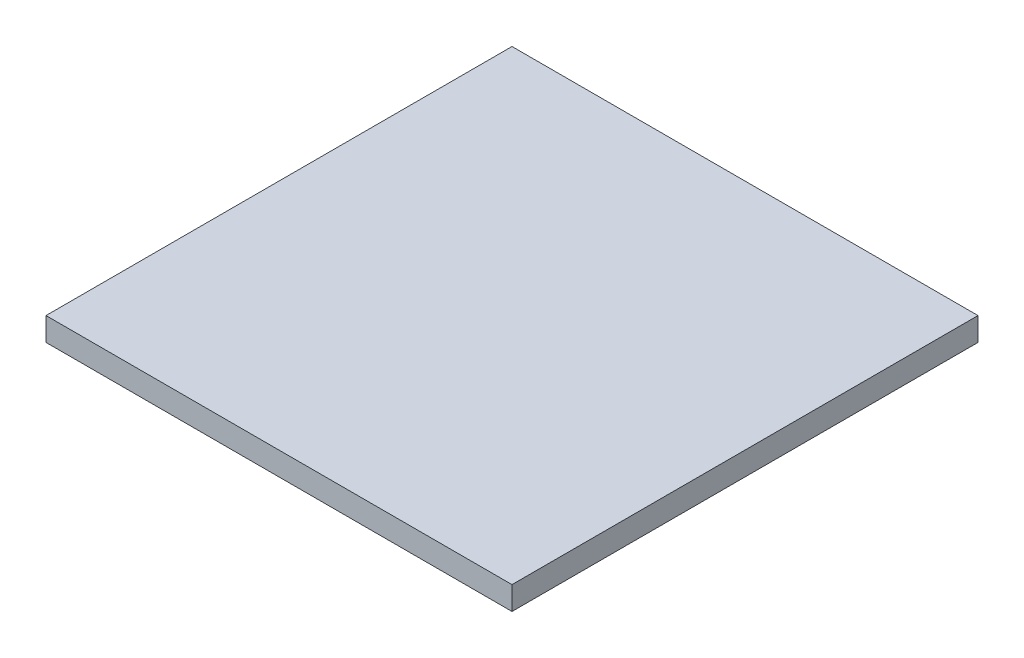
ISO-10303-21;
HEADER;
FILE_DESCRIPTION(('STEP AP214'),'2;1');
FILE_NAME('part.step','',(''),(''),'','','');
FILE_SCHEMA(('AUTOMOTIVE_DESIGN { 1 0 10303 214 1 1 1 1 }'));
ENDSEC;
DATA;
#1=APPLICATION_CONTEXT('core data for automotive mechanical design processes');
#2=APPLICATION_PROTOCOL_DEFINITION('international standard','automotive_design',2000,#1);
#3=PRODUCT_CONTEXT('',#1,'mechanical');
#4=PRODUCT('Part','Part','',(#3));
#5=PRODUCT_RELATED_PRODUCT_CATEGORY('part','',(#4));
#6=PRODUCT_DEFINITION_FORMATION('','',#4);
#7=PRODUCT_DEFINITION_CONTEXT('part definition',#1,'design');
#8=PRODUCT_DEFINITION('design','',#6,#7);
#9=PRODUCT_DEFINITION_SHAPE('','',#8);
#10=(LENGTH_UNIT() NAMED_UNIT(*) SI_UNIT(.MILLI.,.METRE.));
#11=(NAMED_UNIT(*) PLANE_ANGLE_UNIT() SI_UNIT($,.RADIAN.));
#12=(NAMED_UNIT(*) SI_UNIT($,.STERADIAN.) SOLID_ANGLE_UNIT());
#13=UNCERTAINTY_MEASURE_WITH_UNIT(LENGTH_MEASURE(1.E-05),#10,'distance_accuracy_value','');
#14=(GEOMETRIC_REPRESENTATION_CONTEXT(3) GLOBAL_UNCERTAINTY_ASSIGNED_CONTEXT((#13)) GLOBAL_UNIT_ASSIGNED_CONTEXT((#10,
#11,#12)) REPRESENTATION_CONTEXT('',''));
#15=CARTESIAN_POINT('',(0.,0.,0.));
#16=DIRECTION('',(0.,0.,1.));
#17=DIRECTION('',(1.,0.,0.));
#18=AXIS2_PLACEMENT_3D('',#15,#16,#17);
#19=CARTESIAN_POINT('',(0.,1.,0.));
#20=DIRECTION('',(1.,0.,0.));
#21=DIRECTION('',(0.,0.,-1.));
#22=AXIS2_PLACEMENT_3D('',#19,#20,#21);
#23=PLANE('',#22);
#24=DIRECTION('',(0.,0.,1.));
#25=VECTOR('',#24,1.);
#26=CARTESIAN_POINT('',(0.,0.,0.));
#27=LINE('',#26,#25);
#28=CARTESIAN_POINT('',(0.,0.,-20.));
#29=VERTEX_POINT('',#28);
#30=CARTESIAN_POINT('',(0.,0.,0.));
#31=VERTEX_POINT('',#30);
#32=EDGE_CURVE('E96',#29,#31,#27,.T.);
#33=ORIENTED_EDGE('',*,*,#32,.T.);
#34=DIRECTION('',(0.,-1.,0.));
#35=VECTOR('',#34,1.);
#36=CARTESIAN_POINT('',(0.,1.,0.));
#37=LINE('',#36,#35);
#38=CARTESIAN_POINT('',(0.,1.,0.));
#39=VERTEX_POINT('',#38);
#40=EDGE_CURVE('E11',#39,#31,#37,.T.);
#41=ORIENTED_EDGE('',*,*,#40,.F.);
#42=DIRECTION('',(0.,0.,1.));
#43=VECTOR('',#42,1.);
#44=CARTESIAN_POINT('',(0.,1.,0.));
#45=LINE('',#44,#43);
#46=CARTESIAN_POINT('',(0.,1.,-20.));
#47=VERTEX_POINT('',#46);
#48=EDGE_CURVE('E84',#47,#39,#45,.T.);
#49=ORIENTED_EDGE('',*,*,#48,.F.);
#50=DIRECTION('',(0.,-1.,0.));
#51=VECTOR('',#50,1.);
#52=CARTESIAN_POINT('',(0.,1.,-20.));
#53=LINE('',#52,#51);
#54=EDGE_CURVE('E92',#47,#29,#53,.T.);
#55=ORIENTED_EDGE('',*,*,#54,.T.);
#56=EDGE_LOOP('',(#33,#41,#49,#55));
#57=FACE_BOUND('',#56,.T.);
#58=ADVANCED_FACE('F33',(#57),#23,.F.);
#59=CARTESIAN_POINT('',(0.,1.,0.));
#60=DIRECTION('',(0.,0.,-1.));
#61=DIRECTION('',(-1.,0.,0.));
#62=AXIS2_PLACEMENT_3D('',#59,#60,#61);
#63=PLANE('',#62);
#64=DIRECTION('',(1.,0.,0.));
#65=VECTOR('',#64,1.);
#66=CARTESIAN_POINT('',(0.,0.,0.));
#67=LINE('',#66,#65);
#68=CARTESIAN_POINT('',(20.,0.,0.));
#69=VERTEX_POINT('',#68);
#70=EDGE_CURVE('E88',#31,#69,#67,.T.);
#71=ORIENTED_EDGE('',*,*,#70,.T.);
#72=DIRECTION('',(0.,-1.,0.));
#73=VECTOR('',#72,1.);
#74=CARTESIAN_POINT('',(20.,1.,0.));
#75=LINE('',#74,#73);
#76=CARTESIAN_POINT('',(20.,1.,0.));
#77=VERTEX_POINT('',#76);
#78=EDGE_CURVE('E41',#77,#69,#75,.T.);
#79=ORIENTED_EDGE('',*,*,#78,.F.);
#80=DIRECTION('',(1.,0.,0.));
#81=VECTOR('',#80,1.);
#82=CARTESIAN_POINT('',(0.,1.,0.));
#83=LINE('',#82,#81);
#84=EDGE_CURVE('E79',#39,#77,#83,.T.);
#85=ORIENTED_EDGE('',*,*,#84,.F.);
#86=ORIENTED_EDGE('',*,*,#40,.T.);
#87=EDGE_LOOP('',(#71,#79,#85,#86));
#88=FACE_BOUND('',#87,.T.);
#89=ADVANCED_FACE('F87',(#88),#63,.F.);
#90=CARTESIAN_POINT('',(20.,1.,0.));
#91=DIRECTION('',(-1.,0.,0.));
#92=DIRECTION('',(0.,0.,1.));
#93=AXIS2_PLACEMENT_3D('',#90,#91,#92);
#94=PLANE('',#93);
#95=DIRECTION('',(0.,0.,-1.));
#96=VECTOR('',#95,1.);
#97=CARTESIAN_POINT('',(20.,0.,0.));
#98=LINE('',#97,#96);
#99=CARTESIAN_POINT('',(20.,0.,-20.));
#100=VERTEX_POINT('',#99);
#101=EDGE_CURVE('E66',#69,#100,#98,.T.);
#102=ORIENTED_EDGE('',*,*,#101,.T.);
#103=DIRECTION('',(0.,-1.,0.));
#104=VECTOR('',#103,1.);
#105=CARTESIAN_POINT('',(20.,1.,-20.));
#106=LINE('',#105,#104);
#107=CARTESIAN_POINT('',(20.,1.,-20.));
#108=VERTEX_POINT('',#107);
#109=EDGE_CURVE('E89',#108,#100,#106,.T.);
#110=ORIENTED_EDGE('',*,*,#109,.F.);
#111=DIRECTION('',(0.,0.,-1.));
#112=VECTOR('',#111,1.);
#113=CARTESIAN_POINT('',(20.,1.,0.));
#114=LINE('',#113,#112);
#115=EDGE_CURVE('E82',#77,#108,#114,.T.);
#116=ORIENTED_EDGE('',*,*,#115,.F.);
#117=ORIENTED_EDGE('',*,*,#78,.T.);
#118=EDGE_LOOP('',(#102,#110,#116,#117));
#119=FACE_BOUND('',#118,.T.);
#120=ADVANCED_FACE('F90',(#119),#94,.F.);
#121=CARTESIAN_POINT('',(0.,1.,-20.));
#122=DIRECTION('',(0.,0.,1.));
#123=DIRECTION('',(1.,0.,0.));
#124=AXIS2_PLACEMENT_3D('',#121,#122,#123);
#125=PLANE('',#124);
#126=DIRECTION('',(-1.,0.,0.));
#127=VECTOR('',#126,1.);
#128=CARTESIAN_POINT('',(0.,0.,-20.));
#129=LINE('',#128,#127);
#130=EDGE_CURVE('E72',#100,#29,#129,.T.);
#131=ORIENTED_EDGE('',*,*,#130,.T.);
#132=ORIENTED_EDGE('',*,*,#54,.F.);
#133=DIRECTION('',(-1.,0.,0.));
#134=VECTOR('',#133,1.);
#135=CARTESIAN_POINT('',(0.,1.,-20.));
#136=LINE('',#135,#134);
#137=EDGE_CURVE('E49',#108,#47,#136,.T.);
#138=ORIENTED_EDGE('',*,*,#137,.F.);
#139=ORIENTED_EDGE('',*,*,#109,.T.);
#140=EDGE_LOOP('',(#131,#132,#138,#139));
#141=FACE_BOUND('',#140,.T.);
#142=ADVANCED_FACE('F103',(#141),#125,.F.);
#143=CARTESIAN_POINT('',(0.,1.,0.));
#144=DIRECTION('',(0.,-1.,0.));
#145=DIRECTION('',(0.,0.,-1.));
#146=AXIS2_PLACEMENT_3D('',#143,#144,#145);
#147=PLANE('',#146);
#148=ORIENTED_EDGE('',*,*,#48,.T.);
#149=ORIENTED_EDGE('',*,*,#84,.T.);
#150=ORIENTED_EDGE('',*,*,#115,.T.);
#151=ORIENTED_EDGE('',*,*,#137,.T.);
#152=EDGE_LOOP('',(#148,#149,#150,#151));
#153=FACE_BOUND('',#152,.T.);
#154=ADVANCED_FACE('F80',(#153),#147,.F.);
#155=CARTESIAN_POINT('',(0.,0.,0.));
#156=DIRECTION('',(0.,-1.,0.));
#157=DIRECTION('',(0.,0.,-1.));
#158=AXIS2_PLACEMENT_3D('',#155,#156,#157);
#159=PLANE('',#158);
#160=ORIENTED_EDGE('',*,*,#32,.F.);
#161=ORIENTED_EDGE('',*,*,#130,.F.);
#162=ORIENTED_EDGE('',*,*,#101,.F.);
#163=ORIENTED_EDGE('',*,*,#70,.F.);
#164=EDGE_LOOP('',(#160,#161,#162,#163));
#165=FACE_BOUND('',#164,.T.);
#166=ADVANCED_FACE('F106',(#165),#159,.T.);
#167=CLOSED_SHELL('',(#58,#89,#120,#142,#154,#166));
#168=MANIFOLD_SOLID_BREP('B2',#167);
#169=ADVANCED_BREP_SHAPE_REPRESENTATION('',(#18,#168),#14);
#170=SHAPE_DEFINITION_REPRESENTATION(#9,#169);
ENDSEC;
END-ISO-10303-21;
